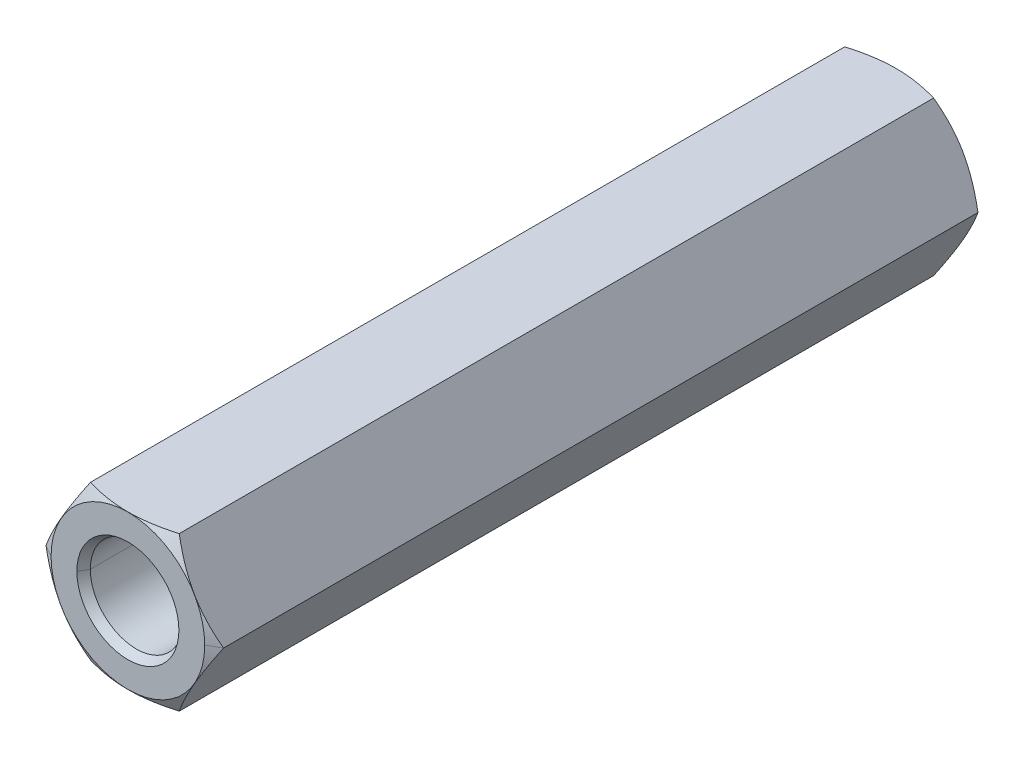
ISO-10303-21;
HEADER;
FILE_DESCRIPTION(('STEP AP214'),'2;1');
FILE_NAME('part.step','',(''),(''),'','','');
FILE_SCHEMA(('AUTOMOTIVE_DESIGN { 1 0 10303 214 1 1 1 1 }'));
ENDSEC;
DATA;
#1=APPLICATION_CONTEXT('core data for automotive mechanical design processes');
#2=APPLICATION_PROTOCOL_DEFINITION('international standard','automotive_design',2000,#1);
#3=PRODUCT_CONTEXT('',#1,'mechanical');
#4=PRODUCT('Part','Part','',(#3));
#5=PRODUCT_RELATED_PRODUCT_CATEGORY('part','',(#4));
#6=PRODUCT_DEFINITION_FORMATION('','',#4);
#7=PRODUCT_DEFINITION_CONTEXT('part definition',#1,'design');
#8=PRODUCT_DEFINITION('design','',#6,#7);
#9=PRODUCT_DEFINITION_SHAPE('','',#8);
#10=(LENGTH_UNIT() NAMED_UNIT(*) SI_UNIT(.MILLI.,.METRE.));
#11=(NAMED_UNIT(*) PLANE_ANGLE_UNIT() SI_UNIT($,.RADIAN.));
#12=(NAMED_UNIT(*) SI_UNIT($,.STERADIAN.) SOLID_ANGLE_UNIT());
#13=UNCERTAINTY_MEASURE_WITH_UNIT(LENGTH_MEASURE(1.E-05),#10,'distance_accuracy_value','');
#14=(GEOMETRIC_REPRESENTATION_CONTEXT(3) GLOBAL_UNCERTAINTY_ASSIGNED_CONTEXT((#13)) GLOBAL_UNIT_ASSIGNED_CONTEXT((#10,
#11,#12)) REPRESENTATION_CONTEXT('',''));
#15=CARTESIAN_POINT('',(0.,0.,0.));
#16=DIRECTION('',(0.,0.,1.));
#17=DIRECTION('',(1.,0.,0.));
#18=AXIS2_PLACEMENT_3D('',#15,#16,#17);
#19=CARTESIAN_POINT('',(220.318744279938,128.56204329235,120.447608312383));
#20=DIRECTION('',(0.,0.,-1.));
#21=DIRECTION('',(1.,0.,0.));
#22=AXIS2_PLACEMENT_3D('',#19,#20,#21);
#23=CONICAL_SURFACE('',#22,1.7320508075705,1.047197551197);
#24=DIRECTION('',(0.86602540378464,0.,-0.499999999999652));
#25=VECTOR('',#24,1.);
#26=CARTESIAN_POINT('',(222.050795087508,128.56204329235,120.447608312383));
#27=LINE('',#26,#25);
#28=CARTESIAN_POINT('',(220.318744279938,128.56204329235,121.447608312383));
#29=VERTEX_POINT('',#28);
#30=CARTESIAN_POINT('',(221.818744279938,128.56204329235,120.581582908599));
#31=VERTEX_POINT('',#30);
#32=EDGE_CURVE('E67',#29,#31,#27,.T.);
#33=ORIENTED_EDGE('',*,*,#32,.F.);
#34=DIRECTION('',(-0.86602540378464,0.,-0.499999999999652));
#35=VECTOR('',#34,1.);
#36=CARTESIAN_POINT('',(218.586693472367,128.56204329235,120.447608312383));
#37=LINE('',#36,#35);
#38=CARTESIAN_POINT('',(218.818744279938,128.56204329235,120.581582908599));
#39=VERTEX_POINT('',#38);
#40=EDGE_CURVE('E11',#29,#39,#37,.T.);
#41=ORIENTED_EDGE('',*,*,#40,.T.);
#42=CARTESIAN_POINT('',(220.318744279938,128.56204329235,120.581582908599));
#43=DIRECTION('',(0.,0.,1.));
#44=DIRECTION('',(1.,0.,0.));
#45=AXIS2_PLACEMENT_3D('',#42,#43,#44);
#46=CIRCLE('',#45,1.5);
#47=EDGE_CURVE('E55',#31,#39,#46,.T.);
#48=ORIENTED_EDGE('',*,*,#47,.F.);
#49=EDGE_LOOP('',(#33,#41,#48));
#50=FACE_BOUND('',#49,.T.);
#51=ADVANCED_FACE('F44',(#50),#23,.F.);
#52=CARTESIAN_POINT('',(220.318744279938,128.56204329235,120.581582908599));
#53=DIRECTION('',(0.,0.,-1.));
#54=DIRECTION('',(1.,0.,0.));
#55=AXIS2_PLACEMENT_3D('',#52,#53,#54);
#56=CYLINDRICAL_SURFACE('',#55,1.5);
#57=ORIENTED_EDGE('',*,*,#47,.T.);
#58=DIRECTION('',(0.,0.,-1.));
#59=VECTOR('',#58,1.);
#60=CARTESIAN_POINT('',(218.818744279938,128.56204329235,120.581582908599));
#61=LINE('',#60,#59);
#62=CARTESIAN_POINT('',(218.818744279938,128.56204329235,110.858711037809));
#63=VERTEX_POINT('',#62);
#64=EDGE_CURVE('E248',#39,#63,#61,.T.);
#65=ORIENTED_EDGE('',*,*,#64,.T.);
#66=CARTESIAN_POINT('',(220.318744279938,128.56204329235,110.858711037809));
#67=DIRECTION('',(0.,0.,1.));
#68=DIRECTION('',(1.,0.,0.));
#69=AXIS2_PLACEMENT_3D('',#66,#67,#68);
#70=CIRCLE('',#69,1.5);
#71=CARTESIAN_POINT('',(221.818744279938,128.56204329235,110.858711037809));
#72=VERTEX_POINT('',#71);
#73=EDGE_CURVE('E245',#72,#63,#70,.T.);
#74=ORIENTED_EDGE('',*,*,#73,.F.);
#75=DIRECTION('',(0.,0.,-1.));
#76=VECTOR('',#75,1.);
#77=CARTESIAN_POINT('',(221.818744279938,128.56204329235,120.581582908599));
#78=LINE('',#77,#76);
#79=EDGE_CURVE('E322',#31,#72,#78,.T.);
#80=ORIENTED_EDGE('',*,*,#79,.F.);
#81=EDGE_LOOP('',(#57,#65,#74,#80));
#82=FACE_BOUND('',#81,.T.);
#83=ADVANCED_FACE('F345',(#82),#56,.F.);
#84=CARTESIAN_POINT('',(220.318744279938,128.56204329235,110.858711037809));
#85=DIRECTION('',(0.,0.,-1.));
#86=DIRECTION('',(1.,0.,0.));
#87=AXIS2_PLACEMENT_3D('',#84,#85,#86);
#88=CONICAL_SURFACE('',#87,1.5,0.5235987756);
#89=ORIENTED_EDGE('',*,*,#73,.T.);
#90=DIRECTION('',(-0.500000000001473,0.,-0.866025403783588));
#91=VECTOR('',#90,1.);
#92=CARTESIAN_POINT('',(218.818744279938,128.56204329235,110.858711037809));
#93=LINE('',#92,#91);
#94=CARTESIAN_POINT('',(218.658744279937,128.56204329235,110.581582908599));
#95=VERTEX_POINT('',#94);
#96=EDGE_CURVE('E203',#63,#95,#93,.T.);
#97=ORIENTED_EDGE('',*,*,#96,.T.);
#98=CARTESIAN_POINT('',(220.318744279938,128.56204329235,110.581582908599));
#99=DIRECTION('',(0.,0.,1.));
#100=DIRECTION('',(1.,0.,0.));
#101=AXIS2_PLACEMENT_3D('',#98,#99,#100);
#102=CIRCLE('',#101,1.66);
#103=CARTESIAN_POINT('',(221.978744279938,128.56204329235,110.581582908599));
#104=VERTEX_POINT('',#103);
#105=EDGE_CURVE('E201',#104,#95,#102,.T.);
#106=ORIENTED_EDGE('',*,*,#105,.F.);
#107=DIRECTION('',(0.500000000001473,0.,-0.866025403783588));
#108=VECTOR('',#107,1.);
#109=CARTESIAN_POINT('',(221.818744279938,128.56204329235,110.858711037809));
#110=LINE('',#109,#108);
#111=EDGE_CURVE('E187',#72,#104,#110,.T.);
#112=ORIENTED_EDGE('',*,*,#111,.F.);
#113=EDGE_LOOP('',(#89,#97,#106,#112));
#114=FACE_BOUND('',#113,.T.);
#115=ADVANCED_FACE('F202',(#114),#88,.F.);
#116=CARTESIAN_POINT('',(220.318744279938,128.56204329235,110.581582908599));
#117=DIRECTION('',(0.,0.,1.));
#118=DIRECTION('',(1.,0.,0.));
#119=AXIS2_PLACEMENT_3D('',#116,#117,#118);
#120=CONICAL_SURFACE('',#119,2.5,1.047197551197);
#121=CARTESIAN_POINT('',(220.318744279938,128.56204329235,110.581582908599));
#122=DIRECTION('',(0.,0.,1.));
#123=DIRECTION('',(1.,0.,0.));
#124=AXIS2_PLACEMENT_3D('',#121,#122,#123);
#125=CIRCLE('',#124,2.5);
#126=CARTESIAN_POINT('',(222.818744279938,128.56204329235,110.581582908599));
#127=VERTEX_POINT('',#126);
#128=CARTESIAN_POINT('',(217.818744279938,128.56204329235,110.581582908599));
#129=VERTEX_POINT('',#128);
#130=EDGE_CURVE('E287',#127,#129,#125,.T.);
#131=ORIENTED_EDGE('',*,*,#130,.T.);
#132=DIRECTION('',(-0.86602540378464,0.,0.499999999999652));
#133=VECTOR('',#132,1.);
#134=CARTESIAN_POINT('',(217.818744279938,128.56204329235,110.581582908599));
#135=LINE('',#134,#133);
#136=CARTESIAN_POINT('',(217.428744279937,128.56204329235,110.806749513583));
#137=VERTEX_POINT('',#136);
#138=EDGE_CURVE('E283',#129,#137,#135,.T.);
#139=ORIENTED_EDGE('',*,*,#138,.T.);
#140=CARTESIAN_POINT('',(218.873744279938,131.064856709287,110.806749513583));
#141=CARTESIAN_POINT('',(218.151244279938,129.813450000819,110.389613944093));
#142=CARTESIAN_POINT('',(217.428744279937,128.56204329235,110.806749513583));
#143=(BOUNDED_CURVE() B_SPLINE_CURVE(2,(#140,#141,#142),.UNSPECIFIED.,.F.,
.F.) B_SPLINE_CURVE_WITH_KNOTS((3,3),(0.,1.),
.UNSPECIFIED.) CURVE() GEOMETRIC_REPRESENTATION_ITEM() RATIONAL_B_SPLINE_CURVE((1.,
1.15470053837935,1.)) REPRESENTATION_ITEM(''));
#144=CARTESIAN_POINT('',(218.873744279938,131.064856709287,110.806749513583));
#145=VERTEX_POINT('',#144);
#146=EDGE_CURVE('E318',#145,#137,#143,.T.);
#147=ORIENTED_EDGE('',*,*,#146,.F.);
#148=CARTESIAN_POINT('',(221.763744279937,131.064856709287,110.806749513583));
#149=CARTESIAN_POINT('',(220.318744279938,131.064856709288,110.389613944093));
#150=CARTESIAN_POINT('',(218.873744279938,131.064856709287,110.806749513583));
#151=(BOUNDED_CURVE() B_SPLINE_CURVE(2,(#148,#149,#150),.UNSPECIFIED.,.F.,
.F.) B_SPLINE_CURVE_WITH_KNOTS((3,3),(0.,1.),
.UNSPECIFIED.) CURVE() GEOMETRIC_REPRESENTATION_ITEM() RATIONAL_B_SPLINE_CURVE((1.,
1.15470053837926,1.)) REPRESENTATION_ITEM(''));
#152=CARTESIAN_POINT('',(221.763744279937,131.064856709287,110.806749513583));
#153=VERTEX_POINT('',#152);
#154=EDGE_CURVE('E282',#153,#145,#151,.T.);
#155=ORIENTED_EDGE('',*,*,#154,.F.);
#156=CARTESIAN_POINT('',(223.208744279937,128.56204329235,110.806749513583));
#157=CARTESIAN_POINT('',(222.486244279938,129.813450000819,110.389613944093));
#158=CARTESIAN_POINT('',(221.763744279937,131.064856709287,110.806749513583));
#159=(BOUNDED_CURVE() B_SPLINE_CURVE(2,(#156,#157,#158),.UNSPECIFIED.,.F.,
.F.) B_SPLINE_CURVE_WITH_KNOTS((3,3),(0.,1.),
.UNSPECIFIED.) CURVE() GEOMETRIC_REPRESENTATION_ITEM() RATIONAL_B_SPLINE_CURVE((1.,
1.15470053837946,1.)) REPRESENTATION_ITEM(''));
#160=CARTESIAN_POINT('',(223.208744279937,128.56204329235,110.806749513583));
#161=VERTEX_POINT('',#160);
#162=EDGE_CURVE('E232',#161,#153,#159,.T.);
#163=ORIENTED_EDGE('',*,*,#162,.F.);
#164=DIRECTION('',(0.86602540378464,0.,0.499999999999652));
#165=VECTOR('',#164,1.);
#166=CARTESIAN_POINT('',(222.818744279938,128.56204329235,110.581582908599));
#167=LINE('',#166,#165);
#168=EDGE_CURVE('E206',#127,#161,#167,.T.);
#169=ORIENTED_EDGE('',*,*,#168,.F.);
#170=EDGE_LOOP('',(#131,#139,#147,#155,#163,#169));
#171=FACE_BOUND('',#170,.T.);
#172=ADVANCED_FACE('F379',(#171),#120,.T.);
#173=CARTESIAN_POINT('',(220.318744279938,128.56204329235,135.356416303615));
#174=DIRECTION('',(0.,0.,-1.));
#175=DIRECTION('',(1.,0.,0.));
#176=AXIS2_PLACEMENT_3D('',#173,#174,#175);
#177=CONICAL_SURFACE('',#176,2.89,1.047197551197);
#178=CARTESIAN_POINT('',(220.318744279938,128.56204329235,135.581582908599));
#179=DIRECTION('',(0.,0.,1.));
#180=DIRECTION('',(1.,0.,0.));
#181=AXIS2_PLACEMENT_3D('',#178,#179,#180);
#182=CIRCLE('',#181,2.5);
#183=CARTESIAN_POINT('',(217.818744279938,128.56204329235,135.581582908599));
#184=VERTEX_POINT('',#183);
#185=CARTESIAN_POINT('',(222.818744279938,128.56204329235,135.581582908599));
#186=VERTEX_POINT('',#185);
#187=EDGE_CURVE('E226',#184,#186,#182,.T.);
#188=ORIENTED_EDGE('',*,*,#187,.F.);
#189=DIRECTION('',(-0.86602540378464,0.,-0.499999999999652));
#190=VECTOR('',#189,1.);
#191=CARTESIAN_POINT('',(217.428744279937,128.56204329235,135.356416303615));
#192=LINE('',#191,#190);
#193=CARTESIAN_POINT('',(217.428744279937,128.56204329235,135.356416303615));
#194=VERTEX_POINT('',#193);
#195=EDGE_CURVE('E288',#184,#194,#192,.T.);
#196=ORIENTED_EDGE('',*,*,#195,.T.);
#197=CARTESIAN_POINT('',(218.873744279938,126.059229875413,135.356416303615));
#198=CARTESIAN_POINT('',(218.151244279937,127.310636583881,135.773551873104));
#199=CARTESIAN_POINT('',(217.428744279937,128.56204329235,135.356416303615));
#200=(BOUNDED_CURVE() B_SPLINE_CURVE(2,(#197,#198,#199),.UNSPECIFIED.,.F.,
.F.) B_SPLINE_CURVE_WITH_KNOTS((3,3),(0.,1.),
.UNSPECIFIED.) CURVE() GEOMETRIC_REPRESENTATION_ITEM() RATIONAL_B_SPLINE_CURVE((1.,
1.15470053837936,1.)) REPRESENTATION_ITEM(''));
#201=CARTESIAN_POINT('',(218.873744279938,126.059229875413,135.356416303615));
#202=VERTEX_POINT('',#201);
#203=EDGE_CURVE('E465',#202,#194,#200,.T.);
#204=ORIENTED_EDGE('',*,*,#203,.F.);
#205=CARTESIAN_POINT('',(221.763744279937,126.059229875413,135.356416303615));
#206=CARTESIAN_POINT('',(220.318744279937,126.059229875413,135.773551873104));
#207=CARTESIAN_POINT('',(218.873744279938,126.059229875413,135.356416303615));
#208=(BOUNDED_CURVE() B_SPLINE_CURVE(2,(#205,#206,#207),.UNSPECIFIED.,.F.,
.F.) B_SPLINE_CURVE_WITH_KNOTS((3,3),(0.,1.),
.UNSPECIFIED.) CURVE() GEOMETRIC_REPRESENTATION_ITEM() RATIONAL_B_SPLINE_CURVE((1.,
1.15470053837925,1.)) REPRESENTATION_ITEM(''));
#209=CARTESIAN_POINT('',(221.763744279937,126.059229875413,135.356416303615));
#210=VERTEX_POINT('',#209);
#211=EDGE_CURVE('E234',#210,#202,#208,.T.);
#212=ORIENTED_EDGE('',*,*,#211,.F.);
#213=CARTESIAN_POINT('',(223.208744279937,128.56204329235,135.356416303615));
#214=CARTESIAN_POINT('',(222.486244279938,127.310636583882,135.773551873104));
#215=CARTESIAN_POINT('',(221.763744279937,126.059229875413,135.356416303615));
#216=(BOUNDED_CURVE() B_SPLINE_CURVE(2,(#213,#214,#215),.UNSPECIFIED.,.F.,
.F.) B_SPLINE_CURVE_WITH_KNOTS((3,3),(0.,1.),
.UNSPECIFIED.) CURVE() GEOMETRIC_REPRESENTATION_ITEM() RATIONAL_B_SPLINE_CURVE((1.,
1.15470053837944,1.)) REPRESENTATION_ITEM(''));
#217=CARTESIAN_POINT('',(223.208744279937,128.56204329235,135.356416303615));
#218=VERTEX_POINT('',#217);
#219=EDGE_CURVE('E331',#218,#210,#216,.T.);
#220=ORIENTED_EDGE('',*,*,#219,.F.);
#221=DIRECTION('',(0.86602540378464,0.,-0.499999999999652));
#222=VECTOR('',#221,1.);
#223=CARTESIAN_POINT('',(223.208744279937,128.56204329235,135.356416303615));
#224=LINE('',#223,#222);
#225=EDGE_CURVE('E48',#186,#218,#224,.T.);
#226=ORIENTED_EDGE('',*,*,#225,.F.);
#227=EDGE_LOOP('',(#188,#196,#204,#212,#220,#226));
#228=FACE_BOUND('',#227,.T.);
#229=ADVANCED_FACE('F375',(#228),#177,.T.);
#230=CARTESIAN_POINT('',(220.318744279938,128.56204329235,135.581582908599));
#231=DIRECTION('',(0.,0.,1.));
#232=DIRECTION('',(1.,0.,0.));
#233=AXIS2_PLACEMENT_3D('',#230,#231,#232);
#234=CONICAL_SURFACE('',#233,1.65999999999899,0.523598775598);
#235=CARTESIAN_POINT('',(220.318744279938,128.56204329235,135.304454779389));
#236=DIRECTION('',(0.,0.,1.));
#237=DIRECTION('',(1.,0.,0.));
#238=AXIS2_PLACEMENT_3D('',#235,#236,#237);
#239=CIRCLE('',#238,1.5);
#240=CARTESIAN_POINT('',(218.818744279938,128.56204329235,135.304454779389));
#241=VERTEX_POINT('',#240);
#242=CARTESIAN_POINT('',(221.818744279938,128.56204329235,135.304454779389));
#243=VERTEX_POINT('',#242);
#244=EDGE_CURVE('E253',#241,#243,#239,.T.);
#245=ORIENTED_EDGE('',*,*,#244,.F.);
#246=DIRECTION('',(-0.499999999999741,0.,0.866025403784588));
#247=VECTOR('',#246,1.);
#248=CARTESIAN_POINT('',(218.658744279938,128.56204329235,135.581582908599));
#249=LINE('',#248,#247);
#250=CARTESIAN_POINT('',(218.658744279938,128.56204329235,135.581582908599));
#251=VERTEX_POINT('',#250);
#252=EDGE_CURVE('E450',#241,#251,#249,.T.);
#253=ORIENTED_EDGE('',*,*,#252,.T.);
#254=CARTESIAN_POINT('',(220.318744279938,128.56204329235,135.581582908599));
#255=DIRECTION('',(0.,0.,1.));
#256=DIRECTION('',(1.,0.,0.));
#257=AXIS2_PLACEMENT_3D('',#254,#255,#256);
#258=CIRCLE('',#257,1.65999999999899);
#259=CARTESIAN_POINT('',(221.978744279937,128.56204329235,135.581582908599));
#260=VERTEX_POINT('',#259);
#261=EDGE_CURVE('E298',#251,#260,#258,.T.);
#262=ORIENTED_EDGE('',*,*,#261,.T.);
#263=DIRECTION('',(0.499999999999741,0.,0.866025403784588));
#264=VECTOR('',#263,1.);
#265=CARTESIAN_POINT('',(221.978744279937,128.56204329235,135.581582908599));
#266=LINE('',#265,#264);
#267=EDGE_CURVE('E142',#243,#260,#266,.T.);
#268=ORIENTED_EDGE('',*,*,#267,.F.);
#269=EDGE_LOOP('',(#245,#253,#262,#268));
#270=FACE_BOUND('',#269,.T.);
#271=ADVANCED_FACE('F378',(#270),#234,.F.);
#272=CARTESIAN_POINT('',(220.318744279938,128.56204329235,135.304454779389));
#273=DIRECTION('',(0.,0.,-1.));
#274=DIRECTION('',(1.,0.,0.));
#275=AXIS2_PLACEMENT_3D('',#272,#273,#274);
#276=CYLINDRICAL_SURFACE('',#275,1.5);
#277=CARTESIAN_POINT('',(220.318744279938,128.56204329235,135.304454779389));
#278=DIRECTION('',(0.,0.,1.));
#279=DIRECTION('',(1.,0.,0.));
#280=AXIS2_PLACEMENT_3D('',#277,#278,#279);
#281=CIRCLE('',#280,1.5);
#282=EDGE_CURVE('E276',#243,#241,#281,.T.);
#283=ORIENTED_EDGE('',*,*,#282,.T.);
#284=DIRECTION('',(0.,0.,-1.));
#285=VECTOR('',#284,1.);
#286=CARTESIAN_POINT('',(218.818744279938,128.56204329235,135.304454779389));
#287=LINE('',#286,#285);
#288=CARTESIAN_POINT('',(218.818744279938,128.56204329235,125.581582908599));
#289=VERTEX_POINT('',#288);
#290=EDGE_CURVE('E269',#241,#289,#287,.T.);
#291=ORIENTED_EDGE('',*,*,#290,.T.);
#292=CARTESIAN_POINT('',(220.318744279938,128.56204329235,125.581582908599));
#293=DIRECTION('',(0.,0.,1.));
#294=DIRECTION('',(1.,0.,0.));
#295=AXIS2_PLACEMENT_3D('',#292,#293,#294);
#296=CIRCLE('',#295,1.5);
#297=CARTESIAN_POINT('',(221.818744279938,128.56204329235,125.581582908599));
#298=VERTEX_POINT('',#297);
#299=EDGE_CURVE('E249',#298,#289,#296,.T.);
#300=ORIENTED_EDGE('',*,*,#299,.F.);
#301=DIRECTION('',(0.,0.,-1.));
#302=VECTOR('',#301,1.);
#303=CARTESIAN_POINT('',(221.818744279938,128.56204329235,135.304454779389));
#304=LINE('',#303,#302);
#305=EDGE_CURVE('E469',#243,#298,#304,.T.);
#306=ORIENTED_EDGE('',*,*,#305,.F.);
#307=EDGE_LOOP('',(#283,#291,#300,#306));
#308=FACE_BOUND('',#307,.T.);
#309=ADVANCED_FACE('F373',(#308),#276,.F.);
#310=CARTESIAN_POINT('',(220.318744279938,128.56204329235,125.581582908599));
#311=DIRECTION('',(0.,0.,1.));
#312=DIRECTION('',(1.,0.,0.));
#313=AXIS2_PLACEMENT_3D('',#310,#311,#312);
#314=CONICAL_SURFACE('',#313,1.5,1.047197551197);
#315=DIRECTION('',(0.86602540378464,0.,0.499999999999652));
#316=VECTOR('',#315,1.);
#317=CARTESIAN_POINT('',(221.818744279938,128.56204329235,125.581582908599));
#318=LINE('',#317,#316);
#319=CARTESIAN_POINT('',(220.318744279938,128.56204329235,124.715557504814));
#320=VERTEX_POINT('',#319);
#321=EDGE_CURVE('E252',#320,#298,#318,.T.);
#322=ORIENTED_EDGE('',*,*,#321,.F.);
#323=DIRECTION('',(-0.86602540378464,0.,0.499999999999652));
#324=VECTOR('',#323,1.);
#325=CARTESIAN_POINT('',(218.818744279938,128.56204329235,125.581582908599));
#326=LINE('',#325,#324);
#327=EDGE_CURVE('E277',#320,#289,#326,.T.);
#328=ORIENTED_EDGE('',*,*,#327,.T.);
#329=CARTESIAN_POINT('',(220.318744279938,128.56204329235,125.581582908599));
#330=DIRECTION('',(0.,0.,1.));
#331=DIRECTION('',(1.,0.,0.));
#332=AXIS2_PLACEMENT_3D('',#329,#330,#331);
#333=CIRCLE('',#332,1.5);
#334=EDGE_CURVE('E310',#289,#298,#333,.T.);
#335=ORIENTED_EDGE('',*,*,#334,.T.);
#336=EDGE_LOOP('',(#322,#328,#335));
#337=FACE_BOUND('',#336,.T.);
#338=ADVANCED_FACE('F369',(#337),#314,.F.);
#339=CARTESIAN_POINT('',(220.318744279938,128.56204329235,125.581582908599));
#340=DIRECTION('',(0.,0.,1.));
#341=DIRECTION('',(1.,0.,0.));
#342=AXIS2_PLACEMENT_3D('',#339,#340,#341);
#343=CONICAL_SURFACE('',#342,1.5,1.047197551197);
#344=ORIENTED_EDGE('',*,*,#327,.F.);
#345=ORIENTED_EDGE('',*,*,#321,.T.);
#346=ORIENTED_EDGE('',*,*,#299,.T.);
#347=EDGE_LOOP('',(#344,#345,#346));
#348=FACE_BOUND('',#347,.T.);
#349=ADVANCED_FACE('F372',(#348),#343,.F.);
#350=CARTESIAN_POINT('',(220.318744279938,128.56204329235,135.304454779389));
#351=DIRECTION('',(0.,0.,-1.));
#352=DIRECTION('',(1.,0.,0.));
#353=AXIS2_PLACEMENT_3D('',#350,#351,#352);
#354=CYLINDRICAL_SURFACE('',#353,1.5);
#355=ORIENTED_EDGE('',*,*,#290,.F.);
#356=ORIENTED_EDGE('',*,*,#244,.T.);
#357=ORIENTED_EDGE('',*,*,#305,.T.);
#358=ORIENTED_EDGE('',*,*,#334,.F.);
#359=EDGE_LOOP('',(#355,#356,#357,#358));
#360=FACE_BOUND('',#359,.T.);
#361=ADVANCED_FACE('F536',(#360),#354,.F.);
#362=CARTESIAN_POINT('',(220.318744279938,128.56204329235,135.581582908599));
#363=DIRECTION('',(0.,0.,1.));
#364=DIRECTION('',(1.,0.,0.));
#365=AXIS2_PLACEMENT_3D('',#362,#363,#364);
#366=CONICAL_SURFACE('',#365,1.65999999999899,0.523598775598);
#367=ORIENTED_EDGE('',*,*,#252,.F.);
#368=ORIENTED_EDGE('',*,*,#282,.F.);
#369=ORIENTED_EDGE('',*,*,#267,.T.);
#370=CARTESIAN_POINT('',(220.318744279938,128.56204329235,135.581582908599));
#371=DIRECTION('',(0.,0.,1.));
#372=DIRECTION('',(1.,0.,0.));
#373=AXIS2_PLACEMENT_3D('',#370,#371,#372);
#374=CIRCLE('',#373,1.65999999999899);
#375=EDGE_CURVE('E225',#260,#251,#374,.T.);
#376=ORIENTED_EDGE('',*,*,#375,.T.);
#377=EDGE_LOOP('',(#367,#368,#369,#376));
#378=FACE_BOUND('',#377,.T.);
#379=ADVANCED_FACE('F366',(#378),#366,.F.);
#380=CARTESIAN_POINT('',(220.318744279938,128.56204329235,135.581582908599));
#381=DIRECTION('',(0.,0.,1.));
#382=DIRECTION('',(1.,0.,0.));
#383=AXIS2_PLACEMENT_3D('',#380,#381,#382);
#384=PLANE('',#383);
#385=CARTESIAN_POINT('',(220.318744279938,128.56204329235,135.581582908599));
#386=DIRECTION('',(0.,0.,1.));
#387=DIRECTION('',(1.,0.,0.));
#388=AXIS2_PLACEMENT_3D('',#385,#386,#387);
#389=CIRCLE('',#388,2.5);
#390=EDGE_CURVE('E222',#186,#184,#389,.T.);
#391=ORIENTED_EDGE('',*,*,#390,.T.);
#392=ORIENTED_EDGE('',*,*,#187,.T.);
#393=EDGE_LOOP('',(#391,#392));
#394=FACE_BOUND('',#393,.T.);
#395=ORIENTED_EDGE('',*,*,#375,.F.);
#396=ORIENTED_EDGE('',*,*,#261,.F.);
#397=EDGE_LOOP('',(#395,#396));
#398=FACE_BOUND('',#397,.T.);
#399=ADVANCED_FACE('F364',(#394,#398),#384,.T.);
#400=CARTESIAN_POINT('',(220.318744279938,128.56204329235,135.356416303615));
#401=DIRECTION('',(0.,0.,-1.));
#402=DIRECTION('',(1.,0.,0.));
#403=AXIS2_PLACEMENT_3D('',#400,#401,#402);
#404=CONICAL_SURFACE('',#403,2.89,1.047197551197);
#405=ORIENTED_EDGE('',*,*,#195,.F.);
#406=ORIENTED_EDGE('',*,*,#390,.F.);
#407=ORIENTED_EDGE('',*,*,#225,.T.);
#408=CARTESIAN_POINT('',(221.763744279937,131.064856709287,135.356416303615));
#409=CARTESIAN_POINT('',(222.486244279938,129.813450000819,135.773551873104));
#410=CARTESIAN_POINT('',(223.208744279937,128.56204329235,135.356416303615));
#411=(BOUNDED_CURVE() B_SPLINE_CURVE(2,(#408,#409,#410),.UNSPECIFIED.,.F.,
.F.) B_SPLINE_CURVE_WITH_KNOTS((3,3),(0.,1.),
.UNSPECIFIED.) CURVE() GEOMETRIC_REPRESENTATION_ITEM() RATIONAL_B_SPLINE_CURVE((1.,
1.15470053837935,1.)) REPRESENTATION_ITEM(''));
#412=CARTESIAN_POINT('',(221.763744279937,131.064856709287,135.356416303615));
#413=VERTEX_POINT('',#412);
#414=EDGE_CURVE('E268',#413,#218,#411,.T.);
#415=ORIENTED_EDGE('',*,*,#414,.F.);
#416=CARTESIAN_POINT('',(218.873744279938,131.064856709287,135.356416303615));
#417=CARTESIAN_POINT('',(220.318744279937,131.064856709287,135.773551873104));
#418=CARTESIAN_POINT('',(221.763744279937,131.064856709287,135.356416303615));
#419=(BOUNDED_CURVE() B_SPLINE_CURVE(2,(#416,#417,#418),.UNSPECIFIED.,.F.,
.F.) B_SPLINE_CURVE_WITH_KNOTS((3,3),(0.,1.),
.UNSPECIFIED.) CURVE() GEOMETRIC_REPRESENTATION_ITEM() RATIONAL_B_SPLINE_CURVE((1.,
1.15470053837925,1.)) REPRESENTATION_ITEM(''));
#420=CARTESIAN_POINT('',(218.873744279938,131.064856709287,135.356416303615));
#421=VERTEX_POINT('',#420);
#422=EDGE_CURVE('E218',#421,#413,#419,.T.);
#423=ORIENTED_EDGE('',*,*,#422,.F.);
#424=CARTESIAN_POINT('',(217.428744279937,128.56204329235,135.356416303615));
#425=CARTESIAN_POINT('',(218.151244279937,129.813450000819,135.773551873104));
#426=CARTESIAN_POINT('',(218.873744279938,131.064856709287,135.356416303615));
#427=(BOUNDED_CURVE() B_SPLINE_CURVE(2,(#424,#425,#426),.UNSPECIFIED.,.F.,
.F.) B_SPLINE_CURVE_WITH_KNOTS((3,3),(0.,1.),
.UNSPECIFIED.) CURVE() GEOMETRIC_REPRESENTATION_ITEM() RATIONAL_B_SPLINE_CURVE((1.,
1.15470053837944,1.)) REPRESENTATION_ITEM(''));
#428=EDGE_CURVE('E445',#194,#421,#427,.T.);
#429=ORIENTED_EDGE('',*,*,#428,.F.);
#430=EDGE_LOOP('',(#405,#406,#407,#415,#423,#429));
#431=FACE_BOUND('',#430,.T.);
#432=ADVANCED_FACE('F362',(#431),#404,.T.);
#433=CARTESIAN_POINT('',(221.763744279937,126.059229875413,110.581582908599));
#434=DIRECTION('',(-0.866025403784329,0.50000000000019,0.));
#435=DIRECTION('',(0.,0.,1.));
#436=AXIS2_PLACEMENT_3D('',#433,#434,#435);
#437=PLANE('',#436);
#438=DIRECTION('',(0.,0.,1.));
#439=VECTOR('',#438,1.);
#440=CARTESIAN_POINT('',(223.208744279937,128.56204329235,110.806749513583));
#441=LINE('',#440,#439);
#442=EDGE_CURVE('E434',#161,#218,#441,.T.);
#443=ORIENTED_EDGE('',*,*,#442,.T.);
#444=ORIENTED_EDGE('',*,*,#219,.T.);
#445=DIRECTION('',(0.,0.,1.));
#446=VECTOR('',#445,1.);
#447=CARTESIAN_POINT('',(221.763744279937,126.059229875413,110.581582908599));
#448=LINE('',#447,#446);
#449=CARTESIAN_POINT('',(221.763744279937,126.059229875413,110.806749513583));
#450=VERTEX_POINT('',#449);
#451=EDGE_CURVE('E239',#450,#210,#448,.T.);
#452=ORIENTED_EDGE('',*,*,#451,.F.);
#453=CARTESIAN_POINT('',(221.763744279937,126.059229875413,110.806749513583));
#454=CARTESIAN_POINT('',(222.486244279938,127.310636583881,110.389613944093));
#455=CARTESIAN_POINT('',(223.208744279937,128.56204329235,110.806749513583));
#456=(BOUNDED_CURVE() B_SPLINE_CURVE(2,(#453,#454,#455),.UNSPECIFIED.,.F.,
.F.) B_SPLINE_CURVE_WITH_KNOTS((3,3),(0.,1.),
.UNSPECIFIED.) CURVE() GEOMETRIC_REPRESENTATION_ITEM() RATIONAL_B_SPLINE_CURVE((1.,
1.15470053837935,1.)) REPRESENTATION_ITEM(''));
#457=EDGE_CURVE('E309',#450,#161,#456,.T.);
#458=ORIENTED_EDGE('',*,*,#457,.T.);
#459=EDGE_LOOP('',(#443,#444,#452,#458));
#460=FACE_BOUND('',#459,.T.);
#461=ADVANCED_FACE('F392',(#460),#437,.F.);
#462=CARTESIAN_POINT('',(218.873744279938,126.059229875413,110.581582908599));
#463=DIRECTION('',(0.,1.,0.));
#464=DIRECTION('',(1.,0.,0.));
#465=AXIS2_PLACEMENT_3D('',#462,#463,#464);
#466=PLANE('',#465);
#467=ORIENTED_EDGE('',*,*,#451,.T.);
#468=ORIENTED_EDGE('',*,*,#211,.T.);
#469=DIRECTION('',(0.,0.,1.));
#470=VECTOR('',#469,1.);
#471=CARTESIAN_POINT('',(218.873744279938,126.059229875413,110.581582908599));
#472=LINE('',#471,#470);
#473=CARTESIAN_POINT('',(218.873744279938,126.059229875413,110.806749513583));
#474=VERTEX_POINT('',#473);
#475=EDGE_CURVE('E259',#474,#202,#472,.T.);
#476=ORIENTED_EDGE('',*,*,#475,.F.);
#477=CARTESIAN_POINT('',(218.873744279938,126.059229875413,110.806749513583));
#478=CARTESIAN_POINT('',(220.318744279938,126.059229875413,110.389613944093));
#479=CARTESIAN_POINT('',(221.763744279937,126.059229875413,110.806749513583));
#480=(BOUNDED_CURVE() B_SPLINE_CURVE(2,(#477,#478,#479),.UNSPECIFIED.,.F.,
.F.) B_SPLINE_CURVE_WITH_KNOTS((3,3),(0.,1.),
.UNSPECIFIED.) CURVE() GEOMETRIC_REPRESENTATION_ITEM() RATIONAL_B_SPLINE_CURVE((1.,
1.15470053837926,1.)) REPRESENTATION_ITEM(''));
#481=EDGE_CURVE('E240',#474,#450,#480,.T.);
#482=ORIENTED_EDGE('',*,*,#481,.T.);
#483=EDGE_LOOP('',(#467,#468,#476,#482));
#484=FACE_BOUND('',#483,.T.);
#485=ADVANCED_FACE('F395',(#484),#466,.F.);
#486=CARTESIAN_POINT('',(217.428744279937,128.56204329235,110.581582908599));
#487=DIRECTION('',(0.866025403784329,0.50000000000019,0.));
#488=DIRECTION('',(0.,0.,-1.));
#489=AXIS2_PLACEMENT_3D('',#486,#487,#488);
#490=PLANE('',#489);
#491=ORIENTED_EDGE('',*,*,#475,.T.);
#492=ORIENTED_EDGE('',*,*,#203,.T.);
#493=DIRECTION('',(0.,0.,1.));
#494=VECTOR('',#493,1.);
#495=CARTESIAN_POINT('',(217.428744279937,128.56204329235,110.581582908599));
#496=LINE('',#495,#494);
#497=EDGE_CURVE('E486',#137,#194,#496,.T.);
#498=ORIENTED_EDGE('',*,*,#497,.F.);
#499=CARTESIAN_POINT('',(217.428744279937,128.56204329235,110.806749513583));
#500=CARTESIAN_POINT('',(218.151244279937,127.310636583882,110.389613944093));
#501=CARTESIAN_POINT('',(218.873744279938,126.059229875413,110.806749513583));
#502=(BOUNDED_CURVE() B_SPLINE_CURVE(2,(#499,#500,#501),.UNSPECIFIED.,.F.,
.F.) B_SPLINE_CURVE_WITH_KNOTS((3,3),(0.,1.),
.UNSPECIFIED.) CURVE() GEOMETRIC_REPRESENTATION_ITEM() RATIONAL_B_SPLINE_CURVE((1.,
1.15470053837945,1.)) REPRESENTATION_ITEM(''));
#503=EDGE_CURVE('E490',#137,#474,#502,.T.);
#504=ORIENTED_EDGE('',*,*,#503,.T.);
#505=EDGE_LOOP('',(#491,#492,#498,#504));
#506=FACE_BOUND('',#505,.T.);
#507=ADVANCED_FACE('F390',(#506),#490,.F.);
#508=CARTESIAN_POINT('',(218.873744279938,131.064856709287,110.581582908599));
#509=DIRECTION('',(0.866025403784329,-0.50000000000019,0.));
#510=DIRECTION('',(0.,0.,-1.));
#511=AXIS2_PLACEMENT_3D('',#508,#509,#510);
#512=PLANE('',#511);
#513=ORIENTED_EDGE('',*,*,#497,.T.);
#514=ORIENTED_EDGE('',*,*,#428,.T.);
#515=DIRECTION('',(0.,0.,1.));
#516=VECTOR('',#515,1.);
#517=CARTESIAN_POINT('',(218.873744279938,131.064856709287,110.581582908599));
#518=LINE('',#517,#516);
#519=EDGE_CURVE('E314',#145,#421,#518,.T.);
#520=ORIENTED_EDGE('',*,*,#519,.F.);
#521=ORIENTED_EDGE('',*,*,#146,.T.);
#522=EDGE_LOOP('',(#513,#514,#520,#521));
#523=FACE_BOUND('',#522,.T.);
#524=ADVANCED_FACE('F386',(#523),#512,.F.);
#525=CARTESIAN_POINT('',(221.763744279937,131.064856709287,110.581582908599));
#526=DIRECTION('',(0.,-1.,0.));
#527=DIRECTION('',(-1.,0.,0.));
#528=AXIS2_PLACEMENT_3D('',#525,#526,#527);
#529=PLANE('',#528);
#530=ORIENTED_EDGE('',*,*,#519,.T.);
#531=ORIENTED_EDGE('',*,*,#422,.T.);
#532=DIRECTION('',(0.,0.,1.));
#533=VECTOR('',#532,1.);
#534=CARTESIAN_POINT('',(221.763744279937,131.064856709287,110.581582908599));
#535=LINE('',#534,#533);
#536=EDGE_CURVE('E278',#153,#413,#535,.T.);
#537=ORIENTED_EDGE('',*,*,#536,.F.);
#538=ORIENTED_EDGE('',*,*,#154,.T.);
#539=EDGE_LOOP('',(#530,#531,#537,#538));
#540=FACE_BOUND('',#539,.T.);
#541=ADVANCED_FACE('F389',(#540),#529,.F.);
#542=CARTESIAN_POINT('',(223.208744279937,128.56204329235,110.581582908599));
#543=DIRECTION('',(-0.866025403784329,-0.50000000000019,0.));
#544=DIRECTION('',(-0.50000000000019,0.866025403784329,0.));
#545=AXIS2_PLACEMENT_3D('',#542,#543,#544);
#546=PLANE('',#545);
#547=ORIENTED_EDGE('',*,*,#536,.T.);
#548=ORIENTED_EDGE('',*,*,#414,.T.);
#549=ORIENTED_EDGE('',*,*,#442,.F.);
#550=ORIENTED_EDGE('',*,*,#162,.T.);
#551=EDGE_LOOP('',(#547,#548,#549,#550));
#552=FACE_BOUND('',#551,.T.);
#553=ADVANCED_FACE('F401',(#552),#546,.F.);
#554=CARTESIAN_POINT('',(220.318744279938,128.56204329235,110.581582908599));
#555=DIRECTION('',(0.,0.,1.));
#556=DIRECTION('',(1.,0.,0.));
#557=AXIS2_PLACEMENT_3D('',#554,#555,#556);
#558=CONICAL_SURFACE('',#557,2.5,1.047197551197);
#559=ORIENTED_EDGE('',*,*,#138,.F.);
#560=CARTESIAN_POINT('',(220.318744279938,128.56204329235,110.581582908599));
#561=DIRECTION('',(0.,0.,1.));
#562=DIRECTION('',(1.,0.,0.));
#563=AXIS2_PLACEMENT_3D('',#560,#561,#562);
#564=CIRCLE('',#563,2.5);
#565=EDGE_CURVE('E229',#129,#127,#564,.T.);
#566=ORIENTED_EDGE('',*,*,#565,.T.);
#567=ORIENTED_EDGE('',*,*,#168,.T.);
#568=ORIENTED_EDGE('',*,*,#457,.F.);
#569=ORIENTED_EDGE('',*,*,#481,.F.);
#570=ORIENTED_EDGE('',*,*,#503,.F.);
#571=EDGE_LOOP('',(#559,#566,#567,#568,#569,#570));
#572=FACE_BOUND('',#571,.T.);
#573=ADVANCED_FACE('F405',(#572),#558,.T.);
#574=CARTESIAN_POINT('',(220.318744279938,128.56204329235,110.581582908599));
#575=DIRECTION('',(0.,0.,1.));
#576=DIRECTION('',(1.,0.,0.));
#577=AXIS2_PLACEMENT_3D('',#574,#575,#576);
#578=PLANE('',#577);
#579=ORIENTED_EDGE('',*,*,#130,.F.);
#580=ORIENTED_EDGE('',*,*,#565,.F.);
#581=EDGE_LOOP('',(#579,#580));
#582=FACE_BOUND('',#581,.T.);
#583=ORIENTED_EDGE('',*,*,#105,.T.);
#584=CARTESIAN_POINT('',(220.318744279938,128.56204329235,110.581582908599));
#585=DIRECTION('',(0.,0.,1.));
#586=DIRECTION('',(1.,0.,0.));
#587=AXIS2_PLACEMENT_3D('',#584,#585,#586);
#588=CIRCLE('',#587,1.66);
#589=EDGE_CURVE('E191',#95,#104,#588,.T.);
#590=ORIENTED_EDGE('',*,*,#589,.T.);
#591=EDGE_LOOP('',(#583,#590));
#592=FACE_BOUND('',#591,.T.);
#593=ADVANCED_FACE('F208',(#582,#592),#578,.F.);
#594=CARTESIAN_POINT('',(220.318744279938,128.56204329235,110.858711037809));
#595=DIRECTION('',(0.,0.,-1.));
#596=DIRECTION('',(1.,0.,0.));
#597=AXIS2_PLACEMENT_3D('',#594,#595,#596);
#598=CONICAL_SURFACE('',#597,1.5,0.5235987756);
#599=ORIENTED_EDGE('',*,*,#96,.F.);
#600=CARTESIAN_POINT('',(220.318744279938,128.56204329235,110.858711037809));
#601=DIRECTION('',(0.,0.,1.));
#602=DIRECTION('',(1.,0.,0.));
#603=AXIS2_PLACEMENT_3D('',#600,#601,#602);
#604=CIRCLE('',#603,1.5);
#605=EDGE_CURVE('E193',#63,#72,#604,.T.);
#606=ORIENTED_EDGE('',*,*,#605,.T.);
#607=ORIENTED_EDGE('',*,*,#111,.T.);
#608=ORIENTED_EDGE('',*,*,#589,.F.);
#609=EDGE_LOOP('',(#599,#606,#607,#608));
#610=FACE_BOUND('',#609,.T.);
#611=ADVANCED_FACE('F189',(#610),#598,.F.);
#612=CARTESIAN_POINT('',(220.318744279938,128.56204329235,120.581582908599));
#613=DIRECTION('',(0.,0.,-1.));
#614=DIRECTION('',(1.,0.,0.));
#615=AXIS2_PLACEMENT_3D('',#612,#613,#614);
#616=CYLINDRICAL_SURFACE('',#615,1.5);
#617=ORIENTED_EDGE('',*,*,#64,.F.);
#618=CARTESIAN_POINT('',(220.318744279938,128.56204329235,120.581582908599));
#619=DIRECTION('',(0.,0.,1.));
#620=DIRECTION('',(1.,0.,0.));
#621=AXIS2_PLACEMENT_3D('',#618,#619,#620);
#622=CIRCLE('',#621,1.5);
#623=EDGE_CURVE('E198',#39,#31,#622,.T.);
#624=ORIENTED_EDGE('',*,*,#623,.T.);
#625=ORIENTED_EDGE('',*,*,#79,.T.);
#626=ORIENTED_EDGE('',*,*,#605,.F.);
#627=EDGE_LOOP('',(#617,#624,#625,#626));
#628=FACE_BOUND('',#627,.T.);
#629=ADVANCED_FACE('F46',(#628),#616,.F.);
#630=CARTESIAN_POINT('',(220.318744279938,128.56204329235,120.447608312383));
#631=DIRECTION('',(0.,0.,-1.));
#632=DIRECTION('',(1.,0.,0.));
#633=AXIS2_PLACEMENT_3D('',#630,#631,#632);
#634=CONICAL_SURFACE('',#633,1.7320508075705,1.047197551197);
#635=ORIENTED_EDGE('',*,*,#40,.F.);
#636=ORIENTED_EDGE('',*,*,#32,.T.);
#637=ORIENTED_EDGE('',*,*,#623,.F.);
#638=EDGE_LOOP('',(#635,#636,#637));
#639=FACE_BOUND('',#638,.T.);
#640=ADVANCED_FACE('F343',(#639),#634,.F.);
#641=CLOSED_SHELL('',(#51,#83,#115,#172,#229,#271,#309,#338,#349,#361,#379,#399,#432,#461,#485,
#507,#524,#541,#553,#573,#593,#611,#629,#640));
#642=MANIFOLD_SOLID_BREP('B2',#641);
#643=ADVANCED_BREP_SHAPE_REPRESENTATION('',(#18,#642),#14);
#644=SHAPE_DEFINITION_REPRESENTATION(#9,#643);
ENDSEC;
END-ISO-10303-21;
